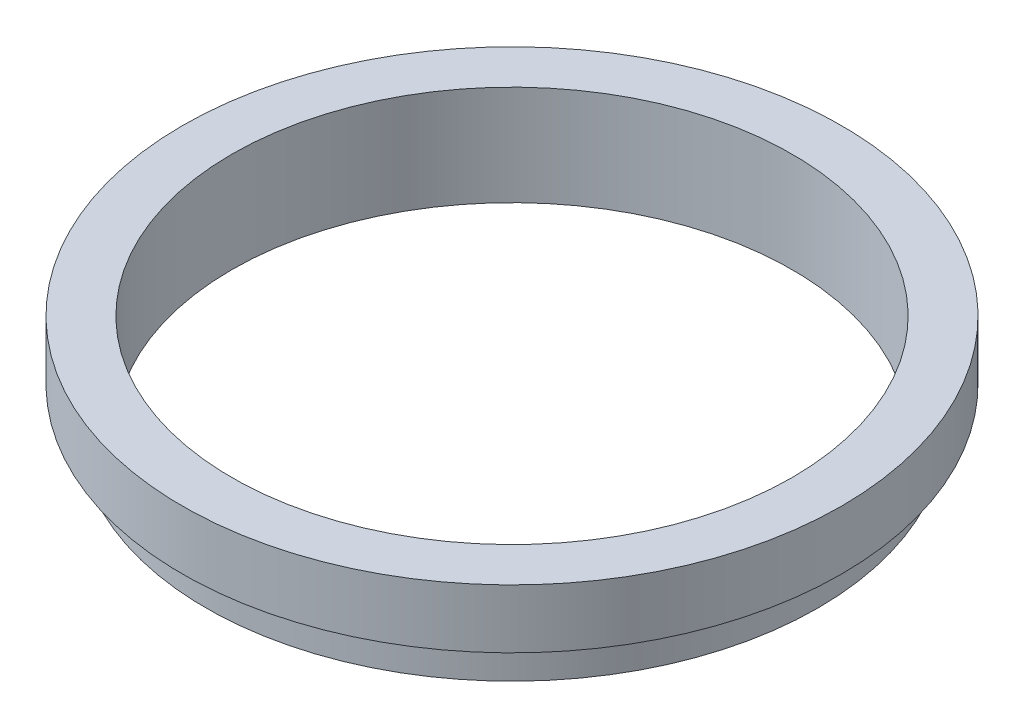
ISO-10303-21;
HEADER;
FILE_DESCRIPTION(('STEP AP214'),'2;1');
FILE_NAME('part.step','',(''),(''),'','','');
FILE_SCHEMA(('AUTOMOTIVE_DESIGN { 1 0 10303 214 1 1 1 1 }'));
ENDSEC;
DATA;
#1=APPLICATION_CONTEXT('core data for automotive mechanical design processes');
#2=APPLICATION_PROTOCOL_DEFINITION('international standard','automotive_design',2000,#1);
#3=PRODUCT_CONTEXT('',#1,'mechanical');
#4=PRODUCT('Part','Part','',(#3));
#5=PRODUCT_RELATED_PRODUCT_CATEGORY('part','',(#4));
#6=PRODUCT_DEFINITION_FORMATION('','',#4);
#7=PRODUCT_DEFINITION_CONTEXT('part definition',#1,'design');
#8=PRODUCT_DEFINITION('design','',#6,#7);
#9=PRODUCT_DEFINITION_SHAPE('','',#8);
#10=(LENGTH_UNIT() NAMED_UNIT(*) SI_UNIT(.MILLI.,.METRE.));
#11=(NAMED_UNIT(*) PLANE_ANGLE_UNIT() SI_UNIT($,.RADIAN.));
#12=(NAMED_UNIT(*) SI_UNIT($,.STERADIAN.) SOLID_ANGLE_UNIT());
#13=UNCERTAINTY_MEASURE_WITH_UNIT(LENGTH_MEASURE(1.E-05),#10,'distance_accuracy_value','');
#14=(GEOMETRIC_REPRESENTATION_CONTEXT(3) GLOBAL_UNCERTAINTY_ASSIGNED_CONTEXT((#13)) GLOBAL_UNIT_ASSIGNED_CONTEXT((#10,
#11,#12)) REPRESENTATION_CONTEXT('',''));
#15=CARTESIAN_POINT('',(0.,0.,0.));
#16=DIRECTION('',(0.,0.,1.));
#17=DIRECTION('',(1.,0.,0.));
#18=AXIS2_PLACEMENT_3D('',#15,#16,#17);
#19=CARTESIAN_POINT('',(23.8,-0.545464411119663,0.));
#20=DIRECTION('',(0.,1.,0.));
#21=DIRECTION('',(-1.,0.,0.));
#22=AXIS2_PLACEMENT_3D('',#19,#20,#21);
#23=PLANE('',#22);
#24=CARTESIAN_POINT('',(0.,-0.545464411119668,0.));
#25=DIRECTION('',(0.,1.,0.));
#26=DIRECTION('',(-1.,0.,0.));
#27=AXIS2_PLACEMENT_3D('',#24,#25,#26);
#28=CIRCLE('',#27,26.);
#29=CARTESIAN_POINT('',(-26.,-0.545464411119672,0.));
#30=VERTEX_POINT('',#29);
#31=EDGE_CURVE('E62',#30,#30,#28,.T.);
#32=ORIENTED_EDGE('',*,*,#31,.F.);
#33=EDGE_LOOP('',(#32));
#34=FACE_BOUND('',#33,.T.);
#35=CARTESIAN_POINT('',(0.,-0.545464411119668,0.));
#36=DIRECTION('',(0.,1.,0.));
#37=DIRECTION('',(-1.,0.,0.));
#38=AXIS2_PLACEMENT_3D('',#35,#36,#37);
#39=CIRCLE('',#38,23.8);
#40=CARTESIAN_POINT('',(-23.8,-0.545464411119671,0.));
#41=VERTEX_POINT('',#40);
#42=EDGE_CURVE('E10',#41,#41,#39,.T.);
#43=ORIENTED_EDGE('',*,*,#42,.T.);
#44=EDGE_LOOP('',(#43));
#45=FACE_BOUND('',#44,.T.);
#46=ADVANCED_FACE('F34',(#34,#45),#23,.F.);
#47=CARTESIAN_POINT('',(0.,16.8860182370821,0.));
#48=DIRECTION('',(0.,1.,0.));
#49=DIRECTION('',(-1.,0.,0.));
#50=AXIS2_PLACEMENT_3D('',#47,#48,#49);
#51=CYLINDRICAL_SURFACE('',#50,23.8);
#52=ORIENTED_EDGE('',*,*,#42,.F.);
#53=EDGE_LOOP('',(#52));
#54=FACE_BOUND('',#53,.T.);
#55=CARTESIAN_POINT('',(0.,7.95453558888033,0.));
#56=DIRECTION('',(0.,1.,0.));
#57=DIRECTION('',(-1.,0.,0.));
#58=AXIS2_PLACEMENT_3D('',#55,#56,#57);
#59=CIRCLE('',#58,23.8);
#60=CARTESIAN_POINT('',(-23.8,7.95453558888033,0.));
#61=VERTEX_POINT('',#60);
#62=EDGE_CURVE('E40',#61,#61,#59,.T.);
#63=ORIENTED_EDGE('',*,*,#62,.T.);
#64=EDGE_LOOP('',(#63));
#65=FACE_BOUND('',#64,.T.);
#66=ADVANCED_FACE('F69',(#54,#65),#51,.F.);
#67=CARTESIAN_POINT('',(23.8,7.95453558888034,0.));
#68=DIRECTION('',(0.,-1.,0.));
#69=DIRECTION('',(1.,0.,0.));
#70=AXIS2_PLACEMENT_3D('',#67,#68,#69);
#71=PLANE('',#70);
#72=ORIENTED_EDGE('',*,*,#62,.F.);
#73=EDGE_LOOP('',(#72));
#74=FACE_BOUND('',#73,.T.);
#75=CARTESIAN_POINT('',(0.,7.95453558888033,0.));
#76=DIRECTION('',(0.,1.,0.));
#77=DIRECTION('',(-1.,0.,0.));
#78=AXIS2_PLACEMENT_3D('',#75,#76,#77);
#79=CIRCLE('',#78,28.);
#80=CARTESIAN_POINT('',(-28.,7.95453558888033,0.));
#81=VERTEX_POINT('',#80);
#82=EDGE_CURVE('E44',#81,#81,#79,.T.);
#83=ORIENTED_EDGE('',*,*,#82,.T.);
#84=EDGE_LOOP('',(#83));
#85=FACE_BOUND('',#84,.T.);
#86=ADVANCED_FACE('F73',(#74,#85),#71,.F.);
#87=CARTESIAN_POINT('',(0.,16.8860182370821,0.));
#88=DIRECTION('',(0.,1.,0.));
#89=DIRECTION('',(-1.,0.,0.));
#90=AXIS2_PLACEMENT_3D('',#87,#88,#89);
#91=CYLINDRICAL_SURFACE('',#90,28.);
#92=ORIENTED_EDGE('',*,*,#82,.F.);
#93=EDGE_LOOP('',(#92));
#94=FACE_BOUND('',#93,.T.);
#95=CARTESIAN_POINT('',(0.,2.95453558888033,0.));
#96=DIRECTION('',(0.,1.,0.));
#97=DIRECTION('',(-1.,0.,0.));
#98=AXIS2_PLACEMENT_3D('',#95,#96,#97);
#99=CIRCLE('',#98,28.);
#100=CARTESIAN_POINT('',(-28.,2.95453558888033,0.));
#101=VERTEX_POINT('',#100);
#102=EDGE_CURVE('E48',#101,#101,#99,.T.);
#103=ORIENTED_EDGE('',*,*,#102,.T.);
#104=EDGE_LOOP('',(#103));
#105=FACE_BOUND('',#104,.T.);
#106=ADVANCED_FACE('F78',(#94,#105),#91,.T.);
#107=CARTESIAN_POINT('',(25.4,2.95453558888034,0.));
#108=DIRECTION('',(0.,1.,0.));
#109=DIRECTION('',(-1.,0.,0.));
#110=AXIS2_PLACEMENT_3D('',#107,#108,#109);
#111=PLANE('',#110);
#112=ORIENTED_EDGE('',*,*,#102,.F.);
#113=EDGE_LOOP('',(#112));
#114=FACE_BOUND('',#113,.T.);
#115=CARTESIAN_POINT('',(0.,2.95453558888033,0.));
#116=DIRECTION('',(0.,1.,0.));
#117=DIRECTION('',(-1.,0.,0.));
#118=AXIS2_PLACEMENT_3D('',#115,#116,#117);
#119=CIRCLE('',#118,25.4);
#120=CARTESIAN_POINT('',(-25.4,2.95453558888033,0.));
#121=VERTEX_POINT('',#120);
#122=EDGE_CURVE('E53',#121,#121,#119,.T.);
#123=ORIENTED_EDGE('',*,*,#122,.T.);
#124=EDGE_LOOP('',(#123));
#125=FACE_BOUND('',#124,.T.);
#126=ADVANCED_FACE('F84',(#114,#125),#111,.F.);
#127=CARTESIAN_POINT('',(0.,16.8860182370821,0.));
#128=DIRECTION('',(0.,1.,0.));
#129=DIRECTION('',(-1.,0.,0.));
#130=AXIS2_PLACEMENT_3D('',#127,#128,#129);
#131=CYLINDRICAL_SURFACE('',#130,25.4);
#132=ORIENTED_EDGE('',*,*,#122,.F.);
#133=EDGE_LOOP('',(#132));
#134=FACE_BOUND('',#133,.T.);
#135=CARTESIAN_POINT('',(0.,1.95453558888033,0.));
#136=DIRECTION('',(0.,1.,0.));
#137=DIRECTION('',(-1.,0.,0.));
#138=AXIS2_PLACEMENT_3D('',#135,#136,#137);
#139=CIRCLE('',#138,25.4);
#140=CARTESIAN_POINT('',(-25.4,1.95453558888033,0.));
#141=VERTEX_POINT('',#140);
#142=EDGE_CURVE('E56',#141,#141,#139,.T.);
#143=ORIENTED_EDGE('',*,*,#142,.T.);
#144=EDGE_LOOP('',(#143));
#145=FACE_BOUND('',#144,.T.);
#146=ADVANCED_FACE('F88',(#134,#145),#131,.T.);
#147=CARTESIAN_POINT('',(25.4,1.95453558888034,0.));
#148=DIRECTION('',(0.,-1.,0.));
#149=DIRECTION('',(1.,0.,0.));
#150=AXIS2_PLACEMENT_3D('',#147,#148,#149);
#151=PLANE('',#150);
#152=ORIENTED_EDGE('',*,*,#142,.F.);
#153=EDGE_LOOP('',(#152));
#154=FACE_BOUND('',#153,.T.);
#155=CARTESIAN_POINT('',(0.,1.95453558888033,0.));
#156=DIRECTION('',(0.,1.,0.));
#157=DIRECTION('',(-1.,0.,0.));
#158=AXIS2_PLACEMENT_3D('',#155,#156,#157);
#159=CIRCLE('',#158,26.);
#160=CARTESIAN_POINT('',(-26.,1.95453558888033,0.));
#161=VERTEX_POINT('',#160);
#162=EDGE_CURVE('E59',#161,#161,#159,.T.);
#163=ORIENTED_EDGE('',*,*,#162,.T.);
#164=EDGE_LOOP('',(#163));
#165=FACE_BOUND('',#164,.T.);
#166=ADVANCED_FACE('F92',(#154,#165),#151,.F.);
#167=CARTESIAN_POINT('',(0.,16.8860182370821,0.));
#168=DIRECTION('',(0.,1.,0.));
#169=DIRECTION('',(-1.,0.,0.));
#170=AXIS2_PLACEMENT_3D('',#167,#168,#169);
#171=CYLINDRICAL_SURFACE('',#170,26.);
#172=ORIENTED_EDGE('',*,*,#162,.F.);
#173=EDGE_LOOP('',(#172));
#174=FACE_BOUND('',#173,.T.);
#175=ORIENTED_EDGE('',*,*,#31,.T.);
#176=EDGE_LOOP('',(#175));
#177=FACE_BOUND('',#176,.T.);
#178=ADVANCED_FACE('F66',(#174,#177),#171,.T.);
#179=CLOSED_SHELL('',(#46,#66,#86,#106,#126,#146,#166,#178));
#180=MANIFOLD_SOLID_BREP('B2',#179);
#181=ADVANCED_BREP_SHAPE_REPRESENTATION('',(#18,#180),#14);
#182=SHAPE_DEFINITION_REPRESENTATION(#9,#181);
ENDSEC;
END-ISO-10303-21;
